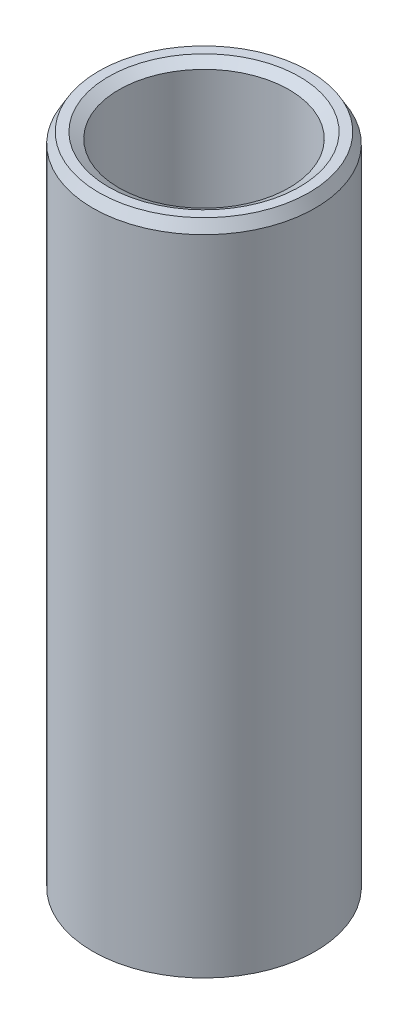
ISO-10303-21;
HEADER;
FILE_DESCRIPTION(('STEP AP214'),'2;1');
FILE_NAME('part.step','',(''),(''),'','','');
FILE_SCHEMA(('AUTOMOTIVE_DESIGN { 1 0 10303 214 1 1 1 1 }'));
ENDSEC;
DATA;
#1=APPLICATION_CONTEXT('core data for automotive mechanical design processes');
#2=APPLICATION_PROTOCOL_DEFINITION('international standard','automotive_design',2000,#1);
#3=PRODUCT_CONTEXT('',#1,'mechanical');
#4=PRODUCT('Part','Part','',(#3));
#5=PRODUCT_RELATED_PRODUCT_CATEGORY('part','',(#4));
#6=PRODUCT_DEFINITION_FORMATION('','',#4);
#7=PRODUCT_DEFINITION_CONTEXT('part definition',#1,'design');
#8=PRODUCT_DEFINITION('design','',#6,#7);
#9=PRODUCT_DEFINITION_SHAPE('','',#8);
#10=(LENGTH_UNIT() NAMED_UNIT(*) SI_UNIT(.MILLI.,.METRE.));
#11=(NAMED_UNIT(*) PLANE_ANGLE_UNIT() SI_UNIT($,.RADIAN.));
#12=(NAMED_UNIT(*) SI_UNIT($,.STERADIAN.) SOLID_ANGLE_UNIT());
#13=UNCERTAINTY_MEASURE_WITH_UNIT(LENGTH_MEASURE(1.E-05),#10,'distance_accuracy_value','');
#14=(GEOMETRIC_REPRESENTATION_CONTEXT(3) GLOBAL_UNCERTAINTY_ASSIGNED_CONTEXT((#13)) GLOBAL_UNIT_ASSIGNED_CONTEXT((#10,
#11,#12)) REPRESENTATION_CONTEXT('',''));
#15=CARTESIAN_POINT('',(0.,0.,0.));
#16=DIRECTION('',(0.,0.,1.));
#17=DIRECTION('',(1.,0.,0.));
#18=AXIS2_PLACEMENT_3D('',#15,#16,#17);
#19=CARTESIAN_POINT('',(0.,222.511324481214,0.));
#20=DIRECTION('',(0.,-1.,0.));
#21=DIRECTION('',(0.,0.,-1.));
#22=AXIS2_PLACEMENT_3D('',#19,#20,#21);
#23=CYLINDRICAL_SURFACE('',#22,37.5);
#24=CARTESIAN_POINT('',(0.,2.03664647378876,0.));
#25=DIRECTION('',(0.,1.,0.));
#26=DIRECTION('',(0.,0.,1.));
#27=AXIS2_PLACEMENT_3D('',#24,#25,#26);
#28=CIRCLE('',#27,37.5);
#29=CARTESIAN_POINT('',(0.,2.03664647378876,37.5));
#30=VERTEX_POINT('',#29);
#31=EDGE_CURVE('E10',#30,#30,#28,.T.);
#32=ORIENTED_EDGE('',*,*,#31,.T.);
#33=EDGE_LOOP('',(#32));
#34=FACE_BOUND('',#33,.T.);
#35=CARTESIAN_POINT('',(0.,218.983749311555,0.));
#36=DIRECTION('',(0.,1.,0.));
#37=DIRECTION('',(0.,0.,1.));
#38=AXIS2_PLACEMENT_3D('',#35,#36,#37);
#39=CIRCLE('',#38,37.5);
#40=CARTESIAN_POINT('',(0.,218.983749311555,37.5));
#41=VERTEX_POINT('',#40);
#42=EDGE_CURVE('E50',#41,#41,#39,.F.);
#43=ORIENTED_EDGE('',*,*,#42,.T.);
#44=EDGE_LOOP('',(#43));
#45=FACE_BOUND('',#44,.T.);
#46=ADVANCED_FACE('F39',(#34,#45),#23,.T.);
#47=CARTESIAN_POINT('',(0.,222.511324481214,0.));
#48=DIRECTION('',(0.,1.,0.));
#49=DIRECTION('',(0.,0.,1.));
#50=AXIS2_PLACEMENT_3D('',#47,#48,#49);
#51=PLANE('',#50);
#52=CARTESIAN_POINT('',(0.,222.511324481214,0.));
#53=DIRECTION('',(0.,1.,0.));
#54=DIRECTION('',(0.,0.,1.));
#55=AXIS2_PLACEMENT_3D('',#52,#53,#54);
#56=CIRCLE('',#55,32.2017019083271);
#57=CARTESIAN_POINT('',(0.,222.511324481214,32.2017019083271));
#58=VERTEX_POINT('',#57);
#59=EDGE_CURVE('E58',#58,#58,#56,.F.);
#60=ORIENTED_EDGE('',*,*,#59,.T.);
#61=EDGE_LOOP('',(#60));
#62=FACE_BOUND('',#61,.T.);
#63=CARTESIAN_POINT('',(0.,222.511324481214,0.));
#64=DIRECTION('',(0.,1.,0.));
#65=DIRECTION('',(0.,0.,1.));
#66=AXIS2_PLACEMENT_3D('',#63,#64,#65);
#67=CIRCLE('',#66,35.4633535262112);
#68=CARTESIAN_POINT('',(0.,222.511324481214,35.4633535262112));
#69=VERTEX_POINT('',#68);
#70=EDGE_CURVE('E61',#69,#69,#67,.T.);
#71=ORIENTED_EDGE('',*,*,#70,.T.);
#72=EDGE_LOOP('',(#71));
#73=FACE_BOUND('',#72,.T.);
#74=ADVANCED_FACE('F88',(#62,#73),#51,.T.);
#75=CARTESIAN_POINT('',(0.,0.,0.));
#76=DIRECTION('',(0.,1.,0.));
#77=DIRECTION('',(0.,0.,1.));
#78=AXIS2_PLACEMENT_3D('',#75,#76,#77);
#79=PLANE('',#78);
#80=CARTESIAN_POINT('',(0.,0.,0.));
#81=DIRECTION('',(0.,1.,0.));
#82=DIRECTION('',(0.,0.,1.));
#83=AXIS2_PLACEMENT_3D('',#80,#81,#82);
#84=CIRCLE('',#83,30.7107732124578);
#85=CARTESIAN_POINT('',(0.,0.,30.7107732124578));
#86=VERTEX_POINT('',#85);
#87=EDGE_CURVE('E51',#86,#86,#84,.T.);
#88=ORIENTED_EDGE('',*,*,#87,.T.);
#89=EDGE_LOOP('',(#88));
#90=FACE_BOUND('',#89,.T.);
#91=CARTESIAN_POINT('',(0.,0.,0.));
#92=DIRECTION('',(0.,1.,0.));
#93=DIRECTION('',(0.,0.,1.));
#94=AXIS2_PLACEMENT_3D('',#91,#92,#93);
#95=CIRCLE('',#94,33.9724248303418);
#96=CARTESIAN_POINT('',(0.,0.,33.9724248303418));
#97=VERTEX_POINT('',#96);
#98=EDGE_CURVE('E54',#97,#97,#95,.F.);
#99=ORIENTED_EDGE('',*,*,#98,.T.);
#100=EDGE_LOOP('',(#99));
#101=FACE_BOUND('',#100,.T.);
#102=ADVANCED_FACE('F83',(#90,#101),#79,.F.);
#103=CARTESIAN_POINT('',(0.,222.511324481214,0.));
#104=DIRECTION('',(0.,-1.,0.));
#105=DIRECTION('',(0.,0.,-1.));
#106=AXIS2_PLACEMENT_3D('',#103,#104,#105);
#107=CYLINDRICAL_SURFACE('',#106,28.674126738669);
#108=CARTESIAN_POINT('',(0.,220.474678007425,0.));
#109=DIRECTION('',(0.,1.,0.));
#110=DIRECTION('',(0.,0.,1.));
#111=AXIS2_PLACEMENT_3D('',#108,#109,#110);
#112=CIRCLE('',#111,28.674126738669);
#113=CARTESIAN_POINT('',(0.,220.474678007425,28.674126738669));
#114=VERTEX_POINT('',#113);
#115=EDGE_CURVE('E67',#114,#114,#112,.T.);
#116=ORIENTED_EDGE('',*,*,#115,.T.);
#117=EDGE_LOOP('',(#116));
#118=FACE_BOUND('',#117,.T.);
#119=CARTESIAN_POINT('',(0.,3.52757516965813,0.));
#120=DIRECTION('',(0.,1.,0.));
#121=DIRECTION('',(0.,0.,1.));
#122=AXIS2_PLACEMENT_3D('',#119,#120,#121);
#123=CIRCLE('',#122,28.674126738669);
#124=CARTESIAN_POINT('',(0.,3.52757516965813,28.674126738669));
#125=VERTEX_POINT('',#124);
#126=EDGE_CURVE('E69',#125,#125,#123,.F.);
#127=ORIENTED_EDGE('',*,*,#126,.T.);
#128=EDGE_LOOP('',(#127));
#129=FACE_BOUND('',#128,.T.);
#130=ADVANCED_FACE('F71',(#118,#129),#107,.F.);
#131=CARTESIAN_POINT('',(0.,220.474678007425,0.));
#132=DIRECTION('',(0.,1.,0.));
#133=DIRECTION('',(0.,0.,1.));
#134=AXIS2_PLACEMENT_3D('',#131,#132,#133);
#135=CONICAL_SURFACE('',#134,28.674126738669,1.0471975511966);
#136=ORIENTED_EDGE('',*,*,#59,.F.);
#137=EDGE_LOOP('',(#136));
#138=FACE_BOUND('',#137,.T.);
#139=ORIENTED_EDGE('',*,*,#115,.F.);
#140=EDGE_LOOP('',(#139));
#141=FACE_BOUND('',#140,.T.);
#142=ADVANCED_FACE('F77',(#138,#141),#135,.F.);
#143=CARTESIAN_POINT('',(0.,0.,0.));
#144=DIRECTION('',(0.,-1.,0.));
#145=DIRECTION('',(0.,0.,-1.));
#146=AXIS2_PLACEMENT_3D('',#143,#144,#145);
#147=CONICAL_SURFACE('',#146,30.7107732124578,0.523598775598298);
#148=ORIENTED_EDGE('',*,*,#126,.F.);
#149=EDGE_LOOP('',(#148));
#150=FACE_BOUND('',#149,.T.);
#151=ORIENTED_EDGE('',*,*,#87,.F.);
#152=EDGE_LOOP('',(#151));
#153=FACE_BOUND('',#152,.T.);
#154=ADVANCED_FACE('F73',(#150,#153),#147,.F.);
#155=CARTESIAN_POINT('',(0.,2.03664647378876,0.));
#156=DIRECTION('',(0.,1.,0.));
#157=DIRECTION('',(0.,0.,1.));
#158=AXIS2_PLACEMENT_3D('',#155,#156,#157);
#159=CONICAL_SURFACE('',#158,37.5,1.0471975511966);
#160=ORIENTED_EDGE('',*,*,#98,.F.);
#161=EDGE_LOOP('',(#160));
#162=FACE_BOUND('',#161,.T.);
#163=ORIENTED_EDGE('',*,*,#31,.F.);
#164=EDGE_LOOP('',(#163));
#165=FACE_BOUND('',#164,.T.);
#166=ADVANCED_FACE('F76',(#162,#165),#159,.T.);
#167=CARTESIAN_POINT('',(0.,222.511324481214,0.));
#168=DIRECTION('',(0.,-1.,0.));
#169=DIRECTION('',(0.,0.,-1.));
#170=AXIS2_PLACEMENT_3D('',#167,#168,#169);
#171=CONICAL_SURFACE('',#170,35.4633535262112,0.523598775598298);
#172=ORIENTED_EDGE('',*,*,#42,.F.);
#173=EDGE_LOOP('',(#172));
#174=FACE_BOUND('',#173,.T.);
#175=ORIENTED_EDGE('',*,*,#70,.F.);
#176=EDGE_LOOP('',(#175));
#177=FACE_BOUND('',#176,.T.);
#178=ADVANCED_FACE('F45',(#174,#177),#171,.T.);
#179=CLOSED_SHELL('',(#46,#74,#102,#130,#142,#154,#166,#178));
#180=MANIFOLD_SOLID_BREP('B2',#179);
#181=ADVANCED_BREP_SHAPE_REPRESENTATION('',(#18,#180),#14);
#182=SHAPE_DEFINITION_REPRESENTATION(#9,#181);
ENDSEC;
END-ISO-10303-21;
